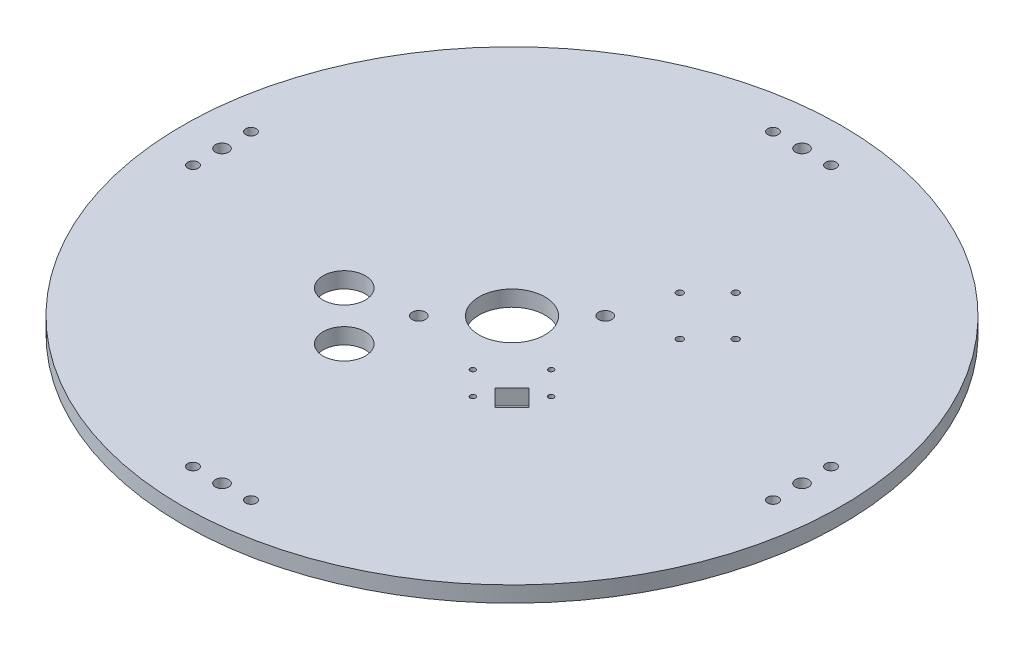
ISO-10303-21;
HEADER;
FILE_DESCRIPTION(('STEP AP214'),'2;1');
FILE_NAME('part.step','',(''),(''),'','','');
FILE_SCHEMA(('AUTOMOTIVE_DESIGN { 1 0 10303 214 1 1 1 1 }'));
ENDSEC;
DATA;
#1=APPLICATION_CONTEXT('core data for automotive mechanical design processes');
#2=APPLICATION_PROTOCOL_DEFINITION('international standard','automotive_design',2000,#1);
#3=PRODUCT_CONTEXT('',#1,'mechanical');
#4=PRODUCT('Part','Part','',(#3));
#5=PRODUCT_RELATED_PRODUCT_CATEGORY('part','',(#4));
#6=PRODUCT_DEFINITION_FORMATION('','',#4);
#7=PRODUCT_DEFINITION_CONTEXT('part definition',#1,'design');
#8=PRODUCT_DEFINITION('design','',#6,#7);
#9=PRODUCT_DEFINITION_SHAPE('','',#8);
#10=(LENGTH_UNIT() NAMED_UNIT(*) SI_UNIT(.MILLI.,.METRE.));
#11=(NAMED_UNIT(*) PLANE_ANGLE_UNIT() SI_UNIT($,.RADIAN.));
#12=(NAMED_UNIT(*) SI_UNIT($,.STERADIAN.) SOLID_ANGLE_UNIT());
#13=UNCERTAINTY_MEASURE_WITH_UNIT(LENGTH_MEASURE(1.E-05),#10,'distance_accuracy_value','');
#14=(GEOMETRIC_REPRESENTATION_CONTEXT(3) GLOBAL_UNCERTAINTY_ASSIGNED_CONTEXT((#13)) GLOBAL_UNIT_ASSIGNED_CONTEXT((#10,
#11,#12)) REPRESENTATION_CONTEXT('',''));
#15=CARTESIAN_POINT('',(0.,0.,0.));
#16=DIRECTION('',(0.,0.,1.));
#17=DIRECTION('',(1.,0.,0.));
#18=AXIS2_PLACEMENT_3D('',#15,#16,#17);
#19=CARTESIAN_POINT('',(0.,6.,0.));
#20=DIRECTION('',(0.,-1.,0.));
#21=DIRECTION('',(0.,0.,-1.));
#22=AXIS2_PLACEMENT_3D('',#19,#20,#21);
#23=CYLINDRICAL_SURFACE('',#22,125.);
#24=CARTESIAN_POINT('',(0.,6.,0.));
#25=DIRECTION('',(0.,1.,0.));
#26=DIRECTION('',(0.,0.,1.));
#27=AXIS2_PLACEMENT_3D('',#24,#25,#26);
#28=CIRCLE('',#27,125.);
#29=CARTESIAN_POINT('',(0.,6.,125.));
#30=VERTEX_POINT('',#29);
#31=EDGE_CURVE('E11',#30,#30,#28,.T.);
#32=ORIENTED_EDGE('',*,*,#31,.F.);
#33=EDGE_LOOP('',(#32));
#34=FACE_BOUND('',#33,.T.);
#35=CARTESIAN_POINT('',(0.,0.,0.));
#36=DIRECTION('',(0.,1.,0.));
#37=DIRECTION('',(0.,0.,1.));
#38=AXIS2_PLACEMENT_3D('',#35,#36,#37);
#39=CIRCLE('',#38,125.);
#40=CARTESIAN_POINT('',(0.,0.,125.));
#41=VERTEX_POINT('',#40);
#42=EDGE_CURVE('E40',#41,#41,#39,.T.);
#43=ORIENTED_EDGE('',*,*,#42,.T.);
#44=EDGE_LOOP('',(#43));
#45=FACE_BOUND('',#44,.T.);
#46=ADVANCED_FACE('F37',(#34,#45),#23,.T.);
#47=CARTESIAN_POINT('',(0.,6.,0.));
#48=DIRECTION('',(0.,1.,0.));
#49=DIRECTION('',(0.,0.,1.));
#50=AXIS2_PLACEMENT_3D('',#47,#48,#49);
#51=PLANE('',#50);
#52=CARTESIAN_POINT('',(-22.6274169979696,6.,41.0121933088197));
#53=DIRECTION('',(0.,1.,0.));
#54=DIRECTION('',(0.,0.,1.));
#55=AXIS2_PLACEMENT_3D('',#52,#53,#54);
#56=CIRCLE('',#55,8.);
#57=CARTESIAN_POINT('',(-22.6274169979696,6.,49.0121933088197));
#58=VERTEX_POINT('',#57);
#59=EDGE_CURVE('E311',#58,#58,#56,.F.);
#60=ORIENTED_EDGE('',*,*,#59,.T.);
#61=EDGE_LOOP('',(#60));
#62=FACE_BOUND('',#61,.T.);
#63=CARTESIAN_POINT('',(-41.0121933088198,6.,22.6274169979694));
#64=DIRECTION('',(0.,1.,0.));
#65=DIRECTION('',(0.,0.,1.));
#66=AXIS2_PLACEMENT_3D('',#63,#64,#65);
#67=CIRCLE('',#66,8.00000000000001);
#68=CARTESIAN_POINT('',(-41.0121933088198,6.,30.6274169979695));
#69=VERTEX_POINT('',#68);
#70=EDGE_CURVE('E314',#69,#69,#67,.F.);
#71=ORIENTED_EDGE('',*,*,#70,.T.);
#72=EDGE_LOOP('',(#71));
#73=FACE_BOUND('',#72,.T.);
#74=CARTESIAN_POINT('',(34.8250089750863,6.,-50.0278047709365));
#75=DIRECTION('',(0.,1.,0.));
#76=DIRECTION('',(0.,0.,1.));
#77=AXIS2_PLACEMENT_3D('',#74,#75,#76);
#78=CIRCLE('',#77,1.24999999959875);
#79=CARTESIAN_POINT('',(34.8250089750863,6.,-48.7778047713378));
#80=VERTEX_POINT('',#79);
#81=EDGE_CURVE('E344',#80,#80,#78,.F.);
#82=ORIENTED_EDGE('',*,*,#81,.T.);
#83=EDGE_LOOP('',(#82));
#84=FACE_BOUND('',#83,.T.);
#85=CARTESIAN_POINT('',(24.2184072572881,6.,-39.4212030531383));
#86=DIRECTION('',(0.,1.,0.));
#87=DIRECTION('',(0.,0.,1.));
#88=AXIS2_PLACEMENT_3D('',#85,#86,#87);
#89=CIRCLE('',#88,1.24999999970731);
#90=CARTESIAN_POINT('',(24.2184072572881,6.,-38.171203053431));
#91=VERTEX_POINT('',#90);
#92=EDGE_CURVE('E341',#91,#91,#89,.F.);
#93=ORIENTED_EDGE('',*,*,#92,.T.);
#94=EDGE_LOOP('',(#93));
#95=FACE_BOUND('',#94,.T.);
#96=CARTESIAN_POINT('',(39.4212030527989,6.,-24.2184072576276));
#97=DIRECTION('',(0.,1.,0.));
#98=DIRECTION('',(0.,0.,1.));
#99=AXIS2_PLACEMENT_3D('',#96,#97,#98);
#100=CIRCLE('',#99,1.25);
#101=CARTESIAN_POINT('',(39.4212030527989,6.,-22.9684072576275));
#102=VERTEX_POINT('',#101);
#103=EDGE_CURVE('E338',#102,#102,#100,.F.);
#104=ORIENTED_EDGE('',*,*,#103,.T.);
#105=EDGE_LOOP('',(#104));
#106=FACE_BOUND('',#105,.T.);
#107=CARTESIAN_POINT('',(50.0278047705971,6.,-34.8250089754258));
#108=DIRECTION('',(0.,1.,0.));
#109=DIRECTION('',(0.,0.,1.));
#110=AXIS2_PLACEMENT_3D('',#107,#108,#109);
#111=CIRCLE('',#110,1.24999999989143);
#112=CARTESIAN_POINT('',(50.0278047705971,6.,-33.5750089755343));
#113=VERTEX_POINT('',#112);
#114=EDGE_CURVE('E327',#113,#113,#111,.F.);
#115=ORIENTED_EDGE('',*,*,#114,.T.);
#116=EDGE_LOOP('',(#115));
#117=FACE_BOUND('',#116,.T.);
#118=CARTESIAN_POINT('',(10.9999999999946,6.,-110.));
#119=DIRECTION('',(0.,1.,0.));
#120=DIRECTION('',(0.,0.,1.));
#121=AXIS2_PLACEMENT_3D('',#118,#119,#120);
#122=CIRCLE('',#121,2.);
#123=CARTESIAN_POINT('',(10.9999999999946,6.,-108.));
#124=VERTEX_POINT('',#123);
#125=EDGE_CURVE('E392',#124,#124,#122,.F.);
#126=ORIENTED_EDGE('',*,*,#125,.T.);
#127=EDGE_LOOP('',(#126));
#128=FACE_BOUND('',#127,.T.);
#129=CARTESIAN_POINT('',(-110.,6.,11.0000000000058));
#130=DIRECTION('',(0.,1.,0.));
#131=DIRECTION('',(0.,0.,1.));
#132=AXIS2_PLACEMENT_3D('',#129,#130,#131);
#133=CIRCLE('',#132,2.00000000000001);
#134=CARTESIAN_POINT('',(-110.,6.,13.0000000000058));
#135=VERTEX_POINT('',#134);
#136=EDGE_CURVE('E389',#135,#135,#133,.F.);
#137=ORIENTED_EDGE('',*,*,#136,.T.);
#138=EDGE_LOOP('',(#137));
#139=FACE_BOUND('',#138,.T.);
#140=CARTESIAN_POINT('',(-110.,6.,-10.9999999999942));
#141=DIRECTION('',(0.,1.,0.));
#142=DIRECTION('',(0.,0.,1.));
#143=AXIS2_PLACEMENT_3D('',#140,#141,#142);
#144=CIRCLE('',#143,2.);
#145=CARTESIAN_POINT('',(-110.,6.,-8.99999999999417));
#146=VERTEX_POINT('',#145);
#147=EDGE_CURVE('E386',#146,#146,#144,.F.);
#148=ORIENTED_EDGE('',*,*,#147,.T.);
#149=EDGE_LOOP('',(#148));
#150=FACE_BOUND('',#149,.T.);
#151=CARTESIAN_POINT('',(11.0000000000062,6.,110.));
#152=DIRECTION('',(0.,1.,0.));
#153=DIRECTION('',(0.,0.,1.));
#154=AXIS2_PLACEMENT_3D('',#151,#152,#153);
#155=CIRCLE('',#154,2.00000000000001);
#156=CARTESIAN_POINT('',(11.0000000000062,6.,112.));
#157=VERTEX_POINT('',#156);
#158=EDGE_CURVE('E383',#157,#157,#155,.F.);
#159=ORIENTED_EDGE('',*,*,#158,.T.);
#160=EDGE_LOOP('',(#159));
#161=FACE_BOUND('',#160,.T.);
#162=CARTESIAN_POINT('',(110.,6.,-11.0000000000051));
#163=DIRECTION('',(0.,1.,0.));
#164=DIRECTION('',(0.,0.,1.));
#165=AXIS2_PLACEMENT_3D('',#162,#163,#164);
#166=CIRCLE('',#165,2.);
#167=CARTESIAN_POINT('',(110.,6.,-9.00000000000506));
#168=VERTEX_POINT('',#167);
#169=EDGE_CURVE('E380',#168,#168,#166,.F.);
#170=ORIENTED_EDGE('',*,*,#169,.T.);
#171=EDGE_LOOP('',(#170));
#172=FACE_BOUND('',#171,.T.);
#173=CARTESIAN_POINT('',(110.,6.,10.9999999999949));
#174=DIRECTION('',(0.,1.,0.));
#175=DIRECTION('',(0.,0.,1.));
#176=AXIS2_PLACEMENT_3D('',#173,#174,#175);
#177=CIRCLE('',#176,2.);
#178=CARTESIAN_POINT('',(110.,6.,12.9999999999949));
#179=VERTEX_POINT('',#178);
#180=EDGE_CURVE('E377',#179,#179,#177,.F.);
#181=ORIENTED_EDGE('',*,*,#180,.T.);
#182=EDGE_LOOP('',(#181));
#183=FACE_BOUND('',#182,.T.);
#184=CARTESIAN_POINT('',(-11.0000000000054,6.,-110.));
#185=DIRECTION('',(0.,1.,0.));
#186=DIRECTION('',(0.,0.,1.));
#187=AXIS2_PLACEMENT_3D('',#184,#185,#186);
#188=CIRCLE('',#187,2.00000000000001);
#189=CARTESIAN_POINT('',(-11.0000000000054,6.,-108.));
#190=VERTEX_POINT('',#189);
#191=EDGE_CURVE('E374',#190,#190,#188,.F.);
#192=ORIENTED_EDGE('',*,*,#191,.T.);
#193=EDGE_LOOP('',(#192));
#194=FACE_BOUND('',#193,.T.);
#195=CARTESIAN_POINT('',(-10.9999999999938,6.,110.));
#196=DIRECTION('',(0.,1.,0.));
#197=DIRECTION('',(0.,0.,1.));
#198=AXIS2_PLACEMENT_3D('',#195,#196,#197);
#199=CIRCLE('',#198,2.);
#200=CARTESIAN_POINT('',(-10.9999999999938,6.,112.));
#201=VERTEX_POINT('',#200);
#202=EDGE_CURVE('E371',#201,#201,#199,.F.);
#203=ORIENTED_EDGE('',*,*,#202,.T.);
#204=EDGE_LOOP('',(#203));
#205=FACE_BOUND('',#204,.T.);
#206=CARTESIAN_POINT('',(19.0918830920367,6.,33.9411254969539));
#207=DIRECTION('',(0.,1.,0.));
#208=DIRECTION('',(0.,0.,1.));
#209=AXIS2_PLACEMENT_3D('',#206,#207,#208);
#210=CIRCLE('',#209,1.);
#211=CARTESIAN_POINT('',(19.0918830920367,6.,34.9411254969539));
#212=VERTEX_POINT('',#211);
#213=EDGE_CURVE('E130',#212,#212,#210,.F.);
#214=ORIENTED_EDGE('',*,*,#213,.T.);
#215=EDGE_LOOP('',(#214));
#216=FACE_BOUND('',#215,.T.);
#217=CARTESIAN_POINT('',(25.1022907321225,6.,10.2530483272047));
#218=DIRECTION('',(0.,1.,0.));
#219=DIRECTION('',(0.,0.,1.));
#220=AXIS2_PLACEMENT_3D('',#217,#218,#219);
#221=CIRCLE('',#220,0.999999999999806);
#222=CARTESIAN_POINT('',(25.1022907321225,6.,11.2530483272045));
#223=VERTEX_POINT('',#222);
#224=EDGE_CURVE('E127',#223,#223,#221,.F.);
#225=ORIENTED_EDGE('',*,*,#224,.T.);
#226=EDGE_LOOP('',(#225));
#227=FACE_BOUND('',#226,.T.);
#228=CARTESIAN_POINT('',(10.2530483272048,6.,25.1022907321221));
#229=DIRECTION('',(0.,1.,0.));
#230=DIRECTION('',(0.,0.,1.));
#231=AXIS2_PLACEMENT_3D('',#228,#229,#230);
#232=CIRCLE('',#231,1.00000000000003);
#233=CARTESIAN_POINT('',(10.2530483272048,6.,26.1022907321221));
#234=VERTEX_POINT('',#233);
#235=EDGE_CURVE('E124',#234,#234,#232,.F.);
#236=ORIENTED_EDGE('',*,*,#235,.T.);
#237=EDGE_LOOP('',(#236));
#238=FACE_BOUND('',#237,.T.);
#239=DIRECTION('',(-0.707106781186548,0.,0.707106781186547));
#240=VECTOR('',#239,1.);
#241=CARTESIAN_POINT('',(30.0520382004282,6.,30.0520382004282));
#242=LINE('',#241,#240);
#243=CARTESIAN_POINT('',(33.2340187157678,6.,26.8700576850885));
#244=VERTEX_POINT('',#243);
#245=CARTESIAN_POINT('',(26.8700576850889,6.,33.2340187157675));
#246=VERTEX_POINT('',#245);
#247=EDGE_CURVE('E118',#244,#246,#242,.T.);
#248=ORIENTED_EDGE('',*,*,#247,.T.);
#249=DIRECTION('',(-0.707106781186548,0.,-0.707106781186547));
#250=VECTOR('',#249,1.);
#251=CARTESIAN_POINT('',(-3.1819805153393,6.,3.1819805153393));
#252=LINE('',#251,#250);
#253=CARTESIAN_POINT('',(20.50609665441,6.,26.8700576850885));
#254=VERTEX_POINT('',#253);
#255=EDGE_CURVE('E121',#246,#254,#252,.T.);
#256=ORIENTED_EDGE('',*,*,#255,.T.);
#257=DIRECTION('',(0.707106781186548,0.,-0.707106781186548));
#258=VECTOR('',#257,1.);
#259=CARTESIAN_POINT('',(23.6880771697493,6.,23.6880771697493));
#260=LINE('',#259,#258);
#261=CARTESIAN_POINT('',(26.8700576850889,6.,20.5060966544096));
#262=VERTEX_POINT('',#261);
#263=EDGE_CURVE('E115',#254,#262,#260,.T.);
#264=ORIENTED_EDGE('',*,*,#263,.T.);
#265=DIRECTION('',(0.707106781186548,0.,0.707106781186547));
#266=VECTOR('',#265,1.);
#267=CARTESIAN_POINT('',(3.18198051533963,6.,-3.18198051533963));
#268=LINE('',#267,#266);
#269=EDGE_CURVE('E83',#262,#244,#268,.T.);
#270=ORIENTED_EDGE('',*,*,#269,.T.);
#271=EDGE_LOOP('',(#248,#256,#264,#270));
#272=FACE_BOUND('',#271,.T.);
#273=CARTESIAN_POINT('',(33.9411254969544,6.,19.0918830920365));
#274=DIRECTION('',(0.,1.,0.));
#275=DIRECTION('',(0.,0.,1.));
#276=AXIS2_PLACEMENT_3D('',#273,#274,#275);
#277=CIRCLE('',#276,0.999999999999781);
#278=CARTESIAN_POINT('',(33.9411254969544,6.,20.0918830920363));
#279=VERTEX_POINT('',#278);
#280=EDGE_CURVE('E112',#279,#279,#277,.F.);
#281=ORIENTED_EDGE('',*,*,#280,.T.);
#282=EDGE_LOOP('',(#281));
#283=FACE_BOUND('',#282,.T.);
#284=CARTESIAN_POINT('',(17.6776695296637,6.,-17.6776695296637));
#285=DIRECTION('',(0.,1.,0.));
#286=DIRECTION('',(0.,0.,1.));
#287=AXIS2_PLACEMENT_3D('',#284,#285,#286);
#288=CIRCLE('',#287,2.5);
#289=CARTESIAN_POINT('',(17.6776695296637,6.,-15.1776695296637));
#290=VERTEX_POINT('',#289);
#291=EDGE_CURVE('E142',#290,#290,#288,.F.);
#292=ORIENTED_EDGE('',*,*,#291,.T.);
#293=EDGE_LOOP('',(#292));
#294=FACE_BOUND('',#293,.T.);
#295=CARTESIAN_POINT('',(-17.6776695296637,6.,17.6776695296637));
#296=DIRECTION('',(0.,1.,0.));
#297=DIRECTION('',(0.,0.,1.));
#298=AXIS2_PLACEMENT_3D('',#295,#296,#297);
#299=CIRCLE('',#298,2.50000000000001);
#300=CARTESIAN_POINT('',(-17.6776695296637,6.,20.1776695296637));
#301=VERTEX_POINT('',#300);
#302=EDGE_CURVE('E137',#301,#301,#299,.F.);
#303=ORIENTED_EDGE('',*,*,#302,.T.);
#304=EDGE_LOOP('',(#303));
#305=FACE_BOUND('',#304,.T.);
#306=CARTESIAN_POINT('',(0.,6.,0.));
#307=DIRECTION('',(0.,1.,0.));
#308=DIRECTION('',(0.,0.,1.));
#309=AXIS2_PLACEMENT_3D('',#306,#307,#308);
#310=CIRCLE('',#309,12.5);
#311=CARTESIAN_POINT('',(0.,6.,12.5));
#312=VERTEX_POINT('',#311);
#313=EDGE_CURVE('E146',#312,#312,#310,.T.);
#314=ORIENTED_EDGE('',*,*,#313,.F.);
#315=EDGE_LOOP('',(#314));
#316=FACE_BOUND('',#315,.T.);
#317=CARTESIAN_POINT('',(0.,6.,-110.));
#318=DIRECTION('',(0.,1.,0.));
#319=DIRECTION('',(0.,0.,1.));
#320=AXIS2_PLACEMENT_3D('',#317,#318,#319);
#321=CIRCLE('',#320,2.5);
#322=CARTESIAN_POINT('',(0.,6.,-107.5));
#323=VERTEX_POINT('',#322);
#324=EDGE_CURVE('E152',#323,#323,#321,.T.);
#325=ORIENTED_EDGE('',*,*,#324,.F.);
#326=EDGE_LOOP('',(#325));
#327=FACE_BOUND('',#326,.T.);
#328=CARTESIAN_POINT('',(110.000000000003,6.,-3.10618136515851E-12));
#329=DIRECTION('',(0.,1.,0.));
#330=DIRECTION('',(0.,0.,1.));
#331=AXIS2_PLACEMENT_3D('',#328,#329,#330);
#332=CIRCLE('',#331,2.50000000000242);
#333=CARTESIAN_POINT('',(110.000000000003,6.,2.49999999999932));
#334=VERTEX_POINT('',#333);
#335=EDGE_CURVE('E161',#334,#334,#332,.T.);
#336=ORIENTED_EDGE('',*,*,#335,.F.);
#337=EDGE_LOOP('',(#336));
#338=FACE_BOUND('',#337,.T.);
#339=CARTESIAN_POINT('',(6.21236273031702E-12,6.,110.));
#340=DIRECTION('',(0.,1.,0.));
#341=DIRECTION('',(0.,0.,1.));
#342=AXIS2_PLACEMENT_3D('',#339,#340,#341);
#343=CIRCLE('',#342,2.50000000000668);
#344=CARTESIAN_POINT('',(6.21236273031702E-12,6.,112.500000000007));
#345=VERTEX_POINT('',#344);
#346=EDGE_CURVE('E167',#345,#345,#343,.T.);
#347=ORIENTED_EDGE('',*,*,#346,.F.);
#348=EDGE_LOOP('',(#347));
#349=FACE_BOUND('',#348,.T.);
#350=CARTESIAN_POINT('',(-109.999999999997,6.,3.11965247994913E-12));
#351=DIRECTION('',(0.,1.,0.));
#352=DIRECTION('',(0.,0.,1.));
#353=AXIS2_PLACEMENT_3D('',#350,#351,#352);
#354=CIRCLE('',#353,2.50000000000499);
#355=CARTESIAN_POINT('',(-109.999999999997,6.,2.50000000000811));
#356=VERTEX_POINT('',#355);
#357=EDGE_CURVE('E149',#356,#356,#354,.T.);
#358=ORIENTED_EDGE('',*,*,#357,.F.);
#359=EDGE_LOOP('',(#358));
#360=FACE_BOUND('',#359,.T.);
#361=ORIENTED_EDGE('',*,*,#31,.T.);
#362=EDGE_LOOP('',(#361));
#363=FACE_BOUND('',#362,.T.);
#364=ADVANCED_FACE('F179',(#62,#73,#84,#95,#106,#117,#128,#139,#150,#161,#172,#183,#194,#205,
#216,#227,#238,#272,#283,#294,#305,#316,#327,#338,#349,#360,#363),#51,.T.);
#365=CARTESIAN_POINT('',(0.,0.,0.));
#366=DIRECTION('',(0.,1.,0.));
#367=DIRECTION('',(0.,0.,1.));
#368=AXIS2_PLACEMENT_3D('',#365,#366,#367);
#369=PLANE('',#368);
#370=CARTESIAN_POINT('',(-22.6274169979696,0.,41.0121933088197));
#371=DIRECTION('',(0.,1.,0.));
#372=DIRECTION('',(0.,0.,1.));
#373=AXIS2_PLACEMENT_3D('',#370,#371,#372);
#374=CIRCLE('',#373,8.);
#375=CARTESIAN_POINT('',(-22.6274169979696,0.,49.0121933088197));
#376=VERTEX_POINT('',#375);
#377=EDGE_CURVE('E313',#376,#376,#374,.T.);
#378=ORIENTED_EDGE('',*,*,#377,.T.);
#379=EDGE_LOOP('',(#378));
#380=FACE_BOUND('',#379,.T.);
#381=CARTESIAN_POINT('',(-41.0121933088198,0.,22.6274169979694));
#382=DIRECTION('',(0.,1.,0.));
#383=DIRECTION('',(0.,0.,1.));
#384=AXIS2_PLACEMENT_3D('',#381,#382,#383);
#385=CIRCLE('',#384,8.00000000000001);
#386=CARTESIAN_POINT('',(-41.0121933088198,0.,30.6274169979695));
#387=VERTEX_POINT('',#386);
#388=EDGE_CURVE('E315',#387,#387,#385,.T.);
#389=ORIENTED_EDGE('',*,*,#388,.T.);
#390=EDGE_LOOP('',(#389));
#391=FACE_BOUND('',#390,.T.);
#392=CARTESIAN_POINT('',(34.8250089750863,0.,-50.0278047709365));
#393=DIRECTION('',(0.,1.,0.));
#394=DIRECTION('',(0.,0.,1.));
#395=AXIS2_PLACEMENT_3D('',#392,#393,#394);
#396=CIRCLE('',#395,1.24999999959875);
#397=CARTESIAN_POINT('',(34.8250089750863,0.,-48.7778047713378));
#398=VERTEX_POINT('',#397);
#399=EDGE_CURVE('E324',#398,#398,#396,.T.);
#400=ORIENTED_EDGE('',*,*,#399,.T.);
#401=EDGE_LOOP('',(#400));
#402=FACE_BOUND('',#401,.T.);
#403=CARTESIAN_POINT('',(24.2184072572881,0.,-39.4212030531383));
#404=DIRECTION('',(0.,1.,0.));
#405=DIRECTION('',(0.,0.,1.));
#406=AXIS2_PLACEMENT_3D('',#403,#404,#405);
#407=CIRCLE('',#406,1.24999999970731);
#408=CARTESIAN_POINT('',(24.2184072572881,0.,-38.171203053431));
#409=VERTEX_POINT('',#408);
#410=EDGE_CURVE('E328',#409,#409,#407,.T.);
#411=ORIENTED_EDGE('',*,*,#410,.T.);
#412=EDGE_LOOP('',(#411));
#413=FACE_BOUND('',#412,.T.);
#414=CARTESIAN_POINT('',(39.4212030527989,0.,-24.2184072576276));
#415=DIRECTION('',(0.,1.,0.));
#416=DIRECTION('',(0.,0.,1.));
#417=AXIS2_PLACEMENT_3D('',#414,#415,#416);
#418=CIRCLE('',#417,1.25);
#419=CARTESIAN_POINT('',(39.4212030527989,0.,-22.9684072576275));
#420=VERTEX_POINT('',#419);
#421=EDGE_CURVE('E331',#420,#420,#418,.T.);
#422=ORIENTED_EDGE('',*,*,#421,.T.);
#423=EDGE_LOOP('',(#422));
#424=FACE_BOUND('',#423,.T.);
#425=CARTESIAN_POINT('',(50.0278047705971,0.,-34.8250089754258));
#426=DIRECTION('',(0.,1.,0.));
#427=DIRECTION('',(0.,0.,1.));
#428=AXIS2_PLACEMENT_3D('',#425,#426,#427);
#429=CIRCLE('',#428,1.24999999989143);
#430=CARTESIAN_POINT('',(50.0278047705971,0.,-33.5750089755343));
#431=VERTEX_POINT('',#430);
#432=EDGE_CURVE('E323',#431,#431,#429,.T.);
#433=ORIENTED_EDGE('',*,*,#432,.T.);
#434=EDGE_LOOP('',(#433));
#435=FACE_BOUND('',#434,.T.);
#436=CARTESIAN_POINT('',(10.9999999999946,0.,-110.));
#437=DIRECTION('',(0.,1.,0.));
#438=DIRECTION('',(0.,0.,1.));
#439=AXIS2_PLACEMENT_3D('',#436,#437,#438);
#440=CIRCLE('',#439,2.);
#441=CARTESIAN_POINT('',(10.9999999999946,0.,-108.));
#442=VERTEX_POINT('',#441);
#443=EDGE_CURVE('E354',#442,#442,#440,.T.);
#444=ORIENTED_EDGE('',*,*,#443,.T.);
#445=EDGE_LOOP('',(#444));
#446=FACE_BOUND('',#445,.T.);
#447=CARTESIAN_POINT('',(-110.,0.,11.0000000000058));
#448=DIRECTION('',(0.,1.,0.));
#449=DIRECTION('',(0.,0.,1.));
#450=AXIS2_PLACEMENT_3D('',#447,#448,#449);
#451=CIRCLE('',#450,2.00000000000001);
#452=CARTESIAN_POINT('',(-110.,0.,13.0000000000058));
#453=VERTEX_POINT('',#452);
#454=EDGE_CURVE('E357',#453,#453,#451,.T.);
#455=ORIENTED_EDGE('',*,*,#454,.T.);
#456=EDGE_LOOP('',(#455));
#457=FACE_BOUND('',#456,.T.);
#458=CARTESIAN_POINT('',(-110.,0.,-10.9999999999942));
#459=DIRECTION('',(0.,1.,0.));
#460=DIRECTION('',(0.,0.,1.));
#461=AXIS2_PLACEMENT_3D('',#458,#459,#460);
#462=CIRCLE('',#461,2.);
#463=CARTESIAN_POINT('',(-110.,0.,-8.99999999999417));
#464=VERTEX_POINT('',#463);
#465=EDGE_CURVE('E360',#464,#464,#462,.T.);
#466=ORIENTED_EDGE('',*,*,#465,.T.);
#467=EDGE_LOOP('',(#466));
#468=FACE_BOUND('',#467,.T.);
#469=CARTESIAN_POINT('',(11.0000000000062,0.,110.));
#470=DIRECTION('',(0.,1.,0.));
#471=DIRECTION('',(0.,0.,1.));
#472=AXIS2_PLACEMENT_3D('',#469,#470,#471);
#473=CIRCLE('',#472,2.00000000000001);
#474=CARTESIAN_POINT('',(11.0000000000062,0.,112.));
#475=VERTEX_POINT('',#474);
#476=EDGE_CURVE('E363',#475,#475,#473,.T.);
#477=ORIENTED_EDGE('',*,*,#476,.T.);
#478=EDGE_LOOP('',(#477));
#479=FACE_BOUND('',#478,.T.);
#480=CARTESIAN_POINT('',(110.,0.,-11.0000000000051));
#481=DIRECTION('',(0.,1.,0.));
#482=DIRECTION('',(0.,0.,1.));
#483=AXIS2_PLACEMENT_3D('',#480,#481,#482);
#484=CIRCLE('',#483,2.);
#485=CARTESIAN_POINT('',(110.,0.,-9.00000000000506));
#486=VERTEX_POINT('',#485);
#487=EDGE_CURVE('E347',#486,#486,#484,.T.);
#488=ORIENTED_EDGE('',*,*,#487,.T.);
#489=EDGE_LOOP('',(#488));
#490=FACE_BOUND('',#489,.T.);
#491=CARTESIAN_POINT('',(110.,0.,10.9999999999949));
#492=DIRECTION('',(0.,1.,0.));
#493=DIRECTION('',(0.,0.,1.));
#494=AXIS2_PLACEMENT_3D('',#491,#492,#493);
#495=CIRCLE('',#494,2.);
#496=CARTESIAN_POINT('',(110.,0.,12.9999999999949));
#497=VERTEX_POINT('',#496);
#498=EDGE_CURVE('E350',#497,#497,#495,.T.);
#499=ORIENTED_EDGE('',*,*,#498,.T.);
#500=EDGE_LOOP('',(#499));
#501=FACE_BOUND('',#500,.T.);
#502=CARTESIAN_POINT('',(-11.0000000000054,0.,-110.));
#503=DIRECTION('',(0.,1.,0.));
#504=DIRECTION('',(0.,0.,1.));
#505=AXIS2_PLACEMENT_3D('',#502,#503,#504);
#506=CIRCLE('',#505,2.00000000000001);
#507=CARTESIAN_POINT('',(-11.0000000000054,0.,-108.));
#508=VERTEX_POINT('',#507);
#509=EDGE_CURVE('E351',#508,#508,#506,.T.);
#510=ORIENTED_EDGE('',*,*,#509,.T.);
#511=EDGE_LOOP('',(#510));
#512=FACE_BOUND('',#511,.T.);
#513=CARTESIAN_POINT('',(-10.9999999999938,0.,110.));
#514=DIRECTION('',(0.,1.,0.));
#515=DIRECTION('',(0.,0.,1.));
#516=AXIS2_PLACEMENT_3D('',#513,#514,#515);
#517=CIRCLE('',#516,2.);
#518=CARTESIAN_POINT('',(-10.9999999999938,0.,112.));
#519=VERTEX_POINT('',#518);
#520=EDGE_CURVE('E366',#519,#519,#517,.T.);
#521=ORIENTED_EDGE('',*,*,#520,.T.);
#522=EDGE_LOOP('',(#521));
#523=FACE_BOUND('',#522,.T.);
#524=CARTESIAN_POINT('',(19.0918830920367,0.,33.9411254969539));
#525=DIRECTION('',(0.,1.,0.));
#526=DIRECTION('',(0.,0.,1.));
#527=AXIS2_PLACEMENT_3D('',#524,#525,#526);
#528=CIRCLE('',#527,1.);
#529=CARTESIAN_POINT('',(19.0918830920367,0.,34.9411254969539));
#530=VERTEX_POINT('',#529);
#531=EDGE_CURVE('E103',#530,#530,#528,.T.);
#532=ORIENTED_EDGE('',*,*,#531,.T.);
#533=EDGE_LOOP('',(#532));
#534=FACE_BOUND('',#533,.T.);
#535=CARTESIAN_POINT('',(25.1022907321225,0.,10.2530483272047));
#536=DIRECTION('',(0.,1.,0.));
#537=DIRECTION('',(0.,0.,1.));
#538=AXIS2_PLACEMENT_3D('',#535,#536,#537);
#539=CIRCLE('',#538,0.999999999999806);
#540=CARTESIAN_POINT('',(25.1022907321225,0.,11.2530483272045));
#541=VERTEX_POINT('',#540);
#542=EDGE_CURVE('E107',#541,#541,#539,.T.);
#543=ORIENTED_EDGE('',*,*,#542,.T.);
#544=EDGE_LOOP('',(#543));
#545=FACE_BOUND('',#544,.T.);
#546=CARTESIAN_POINT('',(10.2530483272048,0.,25.1022907321221));
#547=DIRECTION('',(0.,1.,0.));
#548=DIRECTION('',(0.,0.,1.));
#549=AXIS2_PLACEMENT_3D('',#546,#547,#548);
#550=CIRCLE('',#549,1.00000000000003);
#551=CARTESIAN_POINT('',(10.2530483272048,0.,26.1022907321221));
#552=VERTEX_POINT('',#551);
#553=EDGE_CURVE('E102',#552,#552,#550,.T.);
#554=ORIENTED_EDGE('',*,*,#553,.T.);
#555=EDGE_LOOP('',(#554));
#556=FACE_BOUND('',#555,.T.);
#557=DIRECTION('',(0.707106781186548,0.,0.707106781186547));
#558=VECTOR('',#557,1.);
#559=CARTESIAN_POINT('',(26.8700576850889,0.,33.2340187157675));
#560=LINE('',#559,#558);
#561=CARTESIAN_POINT('',(20.50609665441,0.,26.8700576850885));
#562=VERTEX_POINT('',#561);
#563=CARTESIAN_POINT('',(26.8700576850889,0.,33.2340187157675));
#564=VERTEX_POINT('',#563);
#565=EDGE_CURVE('E59',#562,#564,#560,.T.);
#566=ORIENTED_EDGE('',*,*,#565,.T.);
#567=DIRECTION('',(0.707106781186548,0.,-0.707106781186547));
#568=VECTOR('',#567,1.);
#569=CARTESIAN_POINT('',(33.2340187157678,0.,26.8700576850885));
#570=LINE('',#569,#568);
#571=CARTESIAN_POINT('',(33.2340187157678,0.,26.8700576850885));
#572=VERTEX_POINT('',#571);
#573=EDGE_CURVE('E96',#564,#572,#570,.T.);
#574=ORIENTED_EDGE('',*,*,#573,.T.);
#575=DIRECTION('',(-0.707106781186548,0.,-0.707106781186547));
#576=VECTOR('',#575,1.);
#577=CARTESIAN_POINT('',(33.2340187157678,0.,26.8700576850885));
#578=LINE('',#577,#576);
#579=CARTESIAN_POINT('',(26.8700576850889,0.,20.5060966544096));
#580=VERTEX_POINT('',#579);
#581=EDGE_CURVE('E80',#572,#580,#578,.T.);
#582=ORIENTED_EDGE('',*,*,#581,.T.);
#583=DIRECTION('',(-0.707106781186548,0.,0.707106781186548));
#584=VECTOR('',#583,1.);
#585=CARTESIAN_POINT('',(26.8700576850889,0.,20.5060966544096));
#586=LINE('',#585,#584);
#587=EDGE_CURVE('E89',#580,#562,#586,.T.);
#588=ORIENTED_EDGE('',*,*,#587,.T.);
#589=EDGE_LOOP('',(#566,#574,#582,#588));
#590=FACE_BOUND('',#589,.T.);
#591=CARTESIAN_POINT('',(33.9411254969544,0.,19.0918830920365));
#592=DIRECTION('',(0.,1.,0.));
#593=DIRECTION('',(0.,0.,1.));
#594=AXIS2_PLACEMENT_3D('',#591,#592,#593);
#595=CIRCLE('',#594,0.999999999999781);
#596=CARTESIAN_POINT('',(33.9411254969544,0.,20.0918830920363));
#597=VERTEX_POINT('',#596);
#598=EDGE_CURVE('E106',#597,#597,#595,.T.);
#599=ORIENTED_EDGE('',*,*,#598,.T.);
#600=EDGE_LOOP('',(#599));
#601=FACE_BOUND('',#600,.T.);
#602=CARTESIAN_POINT('',(17.6776695296637,0.,-17.6776695296637));
#603=DIRECTION('',(0.,1.,0.));
#604=DIRECTION('',(0.,0.,1.));
#605=AXIS2_PLACEMENT_3D('',#602,#603,#604);
#606=CIRCLE('',#605,2.5);
#607=CARTESIAN_POINT('',(17.6776695296637,0.,-15.1776695296637));
#608=VERTEX_POINT('',#607);
#609=EDGE_CURVE('E134',#608,#608,#606,.T.);
#610=ORIENTED_EDGE('',*,*,#609,.T.);
#611=EDGE_LOOP('',(#610));
#612=FACE_BOUND('',#611,.T.);
#613=CARTESIAN_POINT('',(-17.6776695296637,0.,17.6776695296637));
#614=DIRECTION('',(0.,1.,0.));
#615=DIRECTION('',(0.,0.,1.));
#616=AXIS2_PLACEMENT_3D('',#613,#614,#615);
#617=CIRCLE('',#616,2.50000000000001);
#618=CARTESIAN_POINT('',(-17.6776695296637,0.,20.1776695296637));
#619=VERTEX_POINT('',#618);
#620=EDGE_CURVE('E133',#619,#619,#617,.T.);
#621=ORIENTED_EDGE('',*,*,#620,.T.);
#622=EDGE_LOOP('',(#621));
#623=FACE_BOUND('',#622,.T.);
#624=CARTESIAN_POINT('',(0.,0.,0.));
#625=DIRECTION('',(0.,1.,0.));
#626=DIRECTION('',(0.,0.,1.));
#627=AXIS2_PLACEMENT_3D('',#624,#625,#626);
#628=CIRCLE('',#627,12.5);
#629=CARTESIAN_POINT('',(0.,0.,12.5));
#630=VERTEX_POINT('',#629);
#631=EDGE_CURVE('E145',#630,#630,#628,.T.);
#632=ORIENTED_EDGE('',*,*,#631,.T.);
#633=EDGE_LOOP('',(#632));
#634=FACE_BOUND('',#633,.T.);
#635=CARTESIAN_POINT('',(0.,0.,-110.));
#636=DIRECTION('',(0.,1.,0.));
#637=DIRECTION('',(0.,0.,1.));
#638=AXIS2_PLACEMENT_3D('',#635,#636,#637);
#639=CIRCLE('',#638,2.5);
#640=CARTESIAN_POINT('',(0.,0.,-107.5));
#641=VERTEX_POINT('',#640);
#642=EDGE_CURVE('E155',#641,#641,#639,.T.);
#643=ORIENTED_EDGE('',*,*,#642,.T.);
#644=EDGE_LOOP('',(#643));
#645=FACE_BOUND('',#644,.T.);
#646=CARTESIAN_POINT('',(110.000000000003,0.,-3.10618136515851E-12));
#647=DIRECTION('',(0.,1.,0.));
#648=DIRECTION('',(0.,0.,1.));
#649=AXIS2_PLACEMENT_3D('',#646,#647,#648);
#650=CIRCLE('',#649,2.50000000000242);
#651=CARTESIAN_POINT('',(110.000000000003,0.,2.49999999999932));
#652=VERTEX_POINT('',#651);
#653=EDGE_CURVE('E158',#652,#652,#650,.T.);
#654=ORIENTED_EDGE('',*,*,#653,.T.);
#655=EDGE_LOOP('',(#654));
#656=FACE_BOUND('',#655,.T.);
#657=CARTESIAN_POINT('',(6.21236273031702E-12,0.,110.));
#658=DIRECTION('',(0.,1.,0.));
#659=DIRECTION('',(0.,0.,1.));
#660=AXIS2_PLACEMENT_3D('',#657,#658,#659);
#661=CIRCLE('',#660,2.50000000000668);
#662=CARTESIAN_POINT('',(6.21236273031702E-12,0.,112.500000000007));
#663=VERTEX_POINT('',#662);
#664=EDGE_CURVE('E164',#663,#663,#661,.T.);
#665=ORIENTED_EDGE('',*,*,#664,.T.);
#666=EDGE_LOOP('',(#665));
#667=FACE_BOUND('',#666,.T.);
#668=CARTESIAN_POINT('',(-109.999999999997,0.,3.11965247994913E-12));
#669=DIRECTION('',(0.,1.,0.));
#670=DIRECTION('',(0.,0.,1.));
#671=AXIS2_PLACEMENT_3D('',#668,#669,#670);
#672=CIRCLE('',#671,2.50000000000499);
#673=CARTESIAN_POINT('',(-109.999999999997,0.,2.50000000000811));
#674=VERTEX_POINT('',#673);
#675=EDGE_CURVE('E170',#674,#674,#672,.T.);
#676=ORIENTED_EDGE('',*,*,#675,.T.);
#677=EDGE_LOOP('',(#676));
#678=FACE_BOUND('',#677,.T.);
#679=ORIENTED_EDGE('',*,*,#42,.F.);
#680=EDGE_LOOP('',(#679));
#681=FACE_BOUND('',#680,.T.);
#682=ADVANCED_FACE('F93',(#380,#391,#402,#413,#424,#435,#446,#457,#468,#479,#490,#501,#512,#523,
#534,#545,#556,#590,#601,#612,#623,#634,#645,#656,#667,#678,#681),#369,.F.);
#683=CARTESIAN_POINT('',(-109.999999999997,6.,3.11965247994913E-12));
#684=DIRECTION('',(0.,-1.,0.));
#685=DIRECTION('',(0.,0.,-1.));
#686=AXIS2_PLACEMENT_3D('',#683,#684,#685);
#687=CYLINDRICAL_SURFACE('',#686,2.50000000000499);
#688=ORIENTED_EDGE('',*,*,#357,.T.);
#689=EDGE_LOOP('',(#688));
#690=FACE_BOUND('',#689,.T.);
#691=ORIENTED_EDGE('',*,*,#675,.F.);
#692=EDGE_LOOP('',(#691));
#693=FACE_BOUND('',#692,.T.);
#694=ADVANCED_FACE('F176',(#690,#693),#687,.F.);
#695=CARTESIAN_POINT('',(6.21236273031702E-12,6.,110.));
#696=DIRECTION('',(0.,-1.,0.));
#697=DIRECTION('',(0.,0.,-1.));
#698=AXIS2_PLACEMENT_3D('',#695,#696,#697);
#699=CYLINDRICAL_SURFACE('',#698,2.50000000000668);
#700=ORIENTED_EDGE('',*,*,#346,.T.);
#701=EDGE_LOOP('',(#700));
#702=FACE_BOUND('',#701,.T.);
#703=ORIENTED_EDGE('',*,*,#664,.F.);
#704=EDGE_LOOP('',(#703));
#705=FACE_BOUND('',#704,.T.);
#706=ADVANCED_FACE('F196',(#702,#705),#699,.F.);
#707=CARTESIAN_POINT('',(110.000000000003,6.,-3.10618136515851E-12));
#708=DIRECTION('',(0.,-1.,0.));
#709=DIRECTION('',(0.,0.,-1.));
#710=AXIS2_PLACEMENT_3D('',#707,#708,#709);
#711=CYLINDRICAL_SURFACE('',#710,2.50000000000242);
#712=ORIENTED_EDGE('',*,*,#335,.T.);
#713=EDGE_LOOP('',(#712));
#714=FACE_BOUND('',#713,.T.);
#715=ORIENTED_EDGE('',*,*,#653,.F.);
#716=EDGE_LOOP('',(#715));
#717=FACE_BOUND('',#716,.T.);
#718=ADVANCED_FACE('F203',(#714,#717),#711,.F.);
#719=CARTESIAN_POINT('',(0.,6.,-110.));
#720=DIRECTION('',(0.,-1.,0.));
#721=DIRECTION('',(0.,0.,-1.));
#722=AXIS2_PLACEMENT_3D('',#719,#720,#721);
#723=CYLINDRICAL_SURFACE('',#722,2.5);
#724=ORIENTED_EDGE('',*,*,#324,.T.);
#725=EDGE_LOOP('',(#724));
#726=FACE_BOUND('',#725,.T.);
#727=ORIENTED_EDGE('',*,*,#642,.F.);
#728=EDGE_LOOP('',(#727));
#729=FACE_BOUND('',#728,.T.);
#730=ADVANCED_FACE('F207',(#726,#729),#723,.F.);
#731=CARTESIAN_POINT('',(0.,6.,0.));
#732=DIRECTION('',(0.,-1.,0.));
#733=DIRECTION('',(0.,0.,-1.));
#734=AXIS2_PLACEMENT_3D('',#731,#732,#733);
#735=CYLINDRICAL_SURFACE('',#734,12.5);
#736=ORIENTED_EDGE('',*,*,#313,.T.);
#737=EDGE_LOOP('',(#736));
#738=FACE_BOUND('',#737,.T.);
#739=ORIENTED_EDGE('',*,*,#631,.F.);
#740=EDGE_LOOP('',(#739));
#741=FACE_BOUND('',#740,.T.);
#742=ADVANCED_FACE('F211',(#738,#741),#735,.F.);
#743=CARTESIAN_POINT('',(-17.6776695296637,10.,17.6776695296637));
#744=DIRECTION('',(0.,-1.,0.));
#745=DIRECTION('',(0.,0.,-1.));
#746=AXIS2_PLACEMENT_3D('',#743,#744,#745);
#747=CYLINDRICAL_SURFACE('',#746,2.50000000000001);
#748=ORIENTED_EDGE('',*,*,#302,.F.);
#749=EDGE_LOOP('',(#748));
#750=FACE_BOUND('',#749,.T.);
#751=ORIENTED_EDGE('',*,*,#620,.F.);
#752=EDGE_LOOP('',(#751));
#753=FACE_BOUND('',#752,.T.);
#754=ADVANCED_FACE('F215',(#750,#753),#747,.F.);
#755=CARTESIAN_POINT('',(17.6776695296637,10.,-17.6776695296637));
#756=DIRECTION('',(0.,-1.,0.));
#757=DIRECTION('',(0.,0.,-1.));
#758=AXIS2_PLACEMENT_3D('',#755,#756,#757);
#759=CYLINDRICAL_SURFACE('',#758,2.5);
#760=ORIENTED_EDGE('',*,*,#291,.F.);
#761=EDGE_LOOP('',(#760));
#762=FACE_BOUND('',#761,.T.);
#763=ORIENTED_EDGE('',*,*,#609,.F.);
#764=EDGE_LOOP('',(#763));
#765=FACE_BOUND('',#764,.T.);
#766=ADVANCED_FACE('F219',(#762,#765),#759,.F.);
#767=CARTESIAN_POINT('',(33.9411254969544,10.,19.0918830920365));
#768=DIRECTION('',(0.,-1.,0.));
#769=DIRECTION('',(0.,0.,-1.));
#770=AXIS2_PLACEMENT_3D('',#767,#768,#769);
#771=CYLINDRICAL_SURFACE('',#770,0.999999999999781);
#772=ORIENTED_EDGE('',*,*,#280,.F.);
#773=EDGE_LOOP('',(#772));
#774=FACE_BOUND('',#773,.T.);
#775=ORIENTED_EDGE('',*,*,#598,.F.);
#776=EDGE_LOOP('',(#775));
#777=FACE_BOUND('',#776,.T.);
#778=ADVANCED_FACE('F223',(#774,#777),#771,.F.);
#779=CARTESIAN_POINT('',(26.8700576850889,10.,33.2340187157675));
#780=DIRECTION('',(0.707106781186547,0.,-0.707106781186548));
#781=DIRECTION('',(-0.707106781186548,0.,-0.707106781186547));
#782=AXIS2_PLACEMENT_3D('',#779,#780,#781);
#783=PLANE('',#782);
#784=DIRECTION('',(0.,-1.,0.));
#785=VECTOR('',#784,1.);
#786=CARTESIAN_POINT('',(26.8700576850889,10.,33.2340187157675));
#787=LINE('',#786,#785);
#788=EDGE_CURVE('E395',#246,#564,#787,.T.);
#789=ORIENTED_EDGE('',*,*,#788,.T.);
#790=ORIENTED_EDGE('',*,*,#565,.F.);
#791=DIRECTION('',(0.,-1.,0.));
#792=VECTOR('',#791,1.);
#793=CARTESIAN_POINT('',(20.50609665441,10.,26.8700576850885));
#794=LINE('',#793,#792);
#795=EDGE_CURVE('E85',#254,#562,#794,.T.);
#796=ORIENTED_EDGE('',*,*,#795,.F.);
#797=ORIENTED_EDGE('',*,*,#255,.F.);
#798=EDGE_LOOP('',(#789,#790,#796,#797));
#799=FACE_BOUND('',#798,.T.);
#800=ADVANCED_FACE('F227',(#799),#783,.T.);
#801=CARTESIAN_POINT('',(33.2340187157678,10.,26.8700576850885));
#802=DIRECTION('',(-0.707106781186547,0.,-0.707106781186548));
#803=DIRECTION('',(-0.707106781186548,0.,0.707106781186547));
#804=AXIS2_PLACEMENT_3D('',#801,#802,#803);
#805=PLANE('',#804);
#806=DIRECTION('',(0.,-1.,0.));
#807=VECTOR('',#806,1.);
#808=CARTESIAN_POINT('',(33.2340187157678,10.,26.8700576850885));
#809=LINE('',#808,#807);
#810=EDGE_CURVE('E86',#244,#572,#809,.T.);
#811=ORIENTED_EDGE('',*,*,#810,.T.);
#812=ORIENTED_EDGE('',*,*,#573,.F.);
#813=ORIENTED_EDGE('',*,*,#788,.F.);
#814=ORIENTED_EDGE('',*,*,#247,.F.);
#815=EDGE_LOOP('',(#811,#812,#813,#814));
#816=FACE_BOUND('',#815,.T.);
#817=ADVANCED_FACE('F243',(#816),#805,.T.);
#818=CARTESIAN_POINT('',(33.2340187157678,10.,26.8700576850885));
#819=DIRECTION('',(-0.707106781186547,0.,0.707106781186548));
#820=DIRECTION('',(0.707106781186548,0.,0.707106781186547));
#821=AXIS2_PLACEMENT_3D('',#818,#819,#820);
#822=PLANE('',#821);
#823=DIRECTION('',(0.,-1.,0.));
#824=VECTOR('',#823,1.);
#825=CARTESIAN_POINT('',(26.8700576850889,10.,20.5060966544096));
#826=LINE('',#825,#824);
#827=EDGE_CURVE('E51',#262,#580,#826,.T.);
#828=ORIENTED_EDGE('',*,*,#827,.T.);
#829=ORIENTED_EDGE('',*,*,#581,.F.);
#830=ORIENTED_EDGE('',*,*,#810,.F.);
#831=ORIENTED_EDGE('',*,*,#269,.F.);
#832=EDGE_LOOP('',(#828,#829,#830,#831));
#833=FACE_BOUND('',#832,.T.);
#834=ADVANCED_FACE('F77',(#833),#822,.T.);
#835=CARTESIAN_POINT('',(26.8700576850889,10.,20.5060966544096));
#836=DIRECTION('',(0.707106781186548,0.,0.707106781186548));
#837=DIRECTION('',(0.707106781186548,0.,-0.707106781186548));
#838=AXIS2_PLACEMENT_3D('',#835,#836,#837);
#839=PLANE('',#838);
#840=ORIENTED_EDGE('',*,*,#795,.T.);
#841=ORIENTED_EDGE('',*,*,#587,.F.);
#842=ORIENTED_EDGE('',*,*,#827,.F.);
#843=ORIENTED_EDGE('',*,*,#263,.F.);
#844=EDGE_LOOP('',(#840,#841,#842,#843));
#845=FACE_BOUND('',#844,.T.);
#846=ADVANCED_FACE('F90',(#845),#839,.T.);
#847=CARTESIAN_POINT('',(10.2530483272048,10.,25.1022907321221));
#848=DIRECTION('',(0.,-1.,0.));
#849=DIRECTION('',(0.,0.,-1.));
#850=AXIS2_PLACEMENT_3D('',#847,#848,#849);
#851=CYLINDRICAL_SURFACE('',#850,1.00000000000003);
#852=ORIENTED_EDGE('',*,*,#235,.F.);
#853=EDGE_LOOP('',(#852));
#854=FACE_BOUND('',#853,.T.);
#855=ORIENTED_EDGE('',*,*,#553,.F.);
#856=EDGE_LOOP('',(#855));
#857=FACE_BOUND('',#856,.T.);
#858=ADVANCED_FACE('F233',(#854,#857),#851,.F.);
#859=CARTESIAN_POINT('',(25.1022907321225,10.,10.2530483272047));
#860=DIRECTION('',(0.,-1.,0.));
#861=DIRECTION('',(0.,0.,-1.));
#862=AXIS2_PLACEMENT_3D('',#859,#860,#861);
#863=CYLINDRICAL_SURFACE('',#862,0.999999999999806);
#864=ORIENTED_EDGE('',*,*,#224,.F.);
#865=EDGE_LOOP('',(#864));
#866=FACE_BOUND('',#865,.T.);
#867=ORIENTED_EDGE('',*,*,#542,.F.);
#868=EDGE_LOOP('',(#867));
#869=FACE_BOUND('',#868,.T.);
#870=ADVANCED_FACE('F229',(#866,#869),#863,.F.);
#871=CARTESIAN_POINT('',(19.0918830920367,10.,33.9411254969539));
#872=DIRECTION('',(0.,-1.,0.));
#873=DIRECTION('',(0.,0.,-1.));
#874=AXIS2_PLACEMENT_3D('',#871,#872,#873);
#875=CYLINDRICAL_SURFACE('',#874,1.);
#876=ORIENTED_EDGE('',*,*,#213,.F.);
#877=EDGE_LOOP('',(#876));
#878=FACE_BOUND('',#877,.T.);
#879=ORIENTED_EDGE('',*,*,#531,.F.);
#880=EDGE_LOOP('',(#879));
#881=FACE_BOUND('',#880,.T.);
#882=ADVANCED_FACE('F232',(#878,#881),#875,.F.);
#883=CARTESIAN_POINT('',(-10.9999999999938,10.,110.));
#884=DIRECTION('',(0.,-1.,0.));
#885=DIRECTION('',(0.,0.,-1.));
#886=AXIS2_PLACEMENT_3D('',#883,#884,#885);
#887=CYLINDRICAL_SURFACE('',#886,2.);
#888=ORIENTED_EDGE('',*,*,#202,.F.);
#889=EDGE_LOOP('',(#888));
#890=FACE_BOUND('',#889,.T.);
#891=ORIENTED_EDGE('',*,*,#520,.F.);
#892=EDGE_LOOP('',(#891));
#893=FACE_BOUND('',#892,.T.);
#894=ADVANCED_FACE('F237',(#890,#893),#887,.F.);
#895=CARTESIAN_POINT('',(-11.0000000000054,10.,-110.));
#896=DIRECTION('',(0.,-1.,0.));
#897=DIRECTION('',(0.,0.,-1.));
#898=AXIS2_PLACEMENT_3D('',#895,#896,#897);
#899=CYLINDRICAL_SURFACE('',#898,2.00000000000001);
#900=ORIENTED_EDGE('',*,*,#191,.F.);
#901=EDGE_LOOP('',(#900));
#902=FACE_BOUND('',#901,.T.);
#903=ORIENTED_EDGE('',*,*,#509,.F.);
#904=EDGE_LOOP('',(#903));
#905=FACE_BOUND('',#904,.T.);
#906=ADVANCED_FACE('F254',(#902,#905),#899,.F.);
#907=CARTESIAN_POINT('',(110.,10.,10.9999999999949));
#908=DIRECTION('',(0.,-1.,0.));
#909=DIRECTION('',(0.,0.,-1.));
#910=AXIS2_PLACEMENT_3D('',#907,#908,#909);
#911=CYLINDRICAL_SURFACE('',#910,2.);
#912=ORIENTED_EDGE('',*,*,#180,.F.);
#913=EDGE_LOOP('',(#912));
#914=FACE_BOUND('',#913,.T.);
#915=ORIENTED_EDGE('',*,*,#498,.F.);
#916=EDGE_LOOP('',(#915));
#917=FACE_BOUND('',#916,.T.);
#918=ADVANCED_FACE('F274',(#914,#917),#911,.F.);
#919=CARTESIAN_POINT('',(110.,10.,-11.0000000000051));
#920=DIRECTION('',(0.,-1.,0.));
#921=DIRECTION('',(0.,0.,-1.));
#922=AXIS2_PLACEMENT_3D('',#919,#920,#921);
#923=CYLINDRICAL_SURFACE('',#922,2.);
#924=ORIENTED_EDGE('',*,*,#169,.F.);
#925=EDGE_LOOP('',(#924));
#926=FACE_BOUND('',#925,.T.);
#927=ORIENTED_EDGE('',*,*,#487,.F.);
#928=EDGE_LOOP('',(#927));
#929=FACE_BOUND('',#928,.T.);
#930=ADVANCED_FACE('F264',(#926,#929),#923,.F.);
#931=CARTESIAN_POINT('',(11.0000000000062,10.,110.));
#932=DIRECTION('',(0.,-1.,0.));
#933=DIRECTION('',(0.,0.,-1.));
#934=AXIS2_PLACEMENT_3D('',#931,#932,#933);
#935=CYLINDRICAL_SURFACE('',#934,2.00000000000001);
#936=ORIENTED_EDGE('',*,*,#158,.F.);
#937=EDGE_LOOP('',(#936));
#938=FACE_BOUND('',#937,.T.);
#939=ORIENTED_EDGE('',*,*,#476,.F.);
#940=EDGE_LOOP('',(#939));
#941=FACE_BOUND('',#940,.T.);
#942=ADVANCED_FACE('F260',(#938,#941),#935,.F.);
#943=CARTESIAN_POINT('',(-110.,10.,-10.9999999999942));
#944=DIRECTION('',(0.,-1.,0.));
#945=DIRECTION('',(0.,0.,-1.));
#946=AXIS2_PLACEMENT_3D('',#943,#944,#945);
#947=CYLINDRICAL_SURFACE('',#946,2.);
#948=ORIENTED_EDGE('',*,*,#147,.F.);
#949=EDGE_LOOP('',(#948));
#950=FACE_BOUND('',#949,.T.);
#951=ORIENTED_EDGE('',*,*,#465,.F.);
#952=EDGE_LOOP('',(#951));
#953=FACE_BOUND('',#952,.T.);
#954=ADVANCED_FACE('F256',(#950,#953),#947,.F.);
#955=CARTESIAN_POINT('',(-110.,10.,11.0000000000058));
#956=DIRECTION('',(0.,-1.,0.));
#957=DIRECTION('',(0.,0.,-1.));
#958=AXIS2_PLACEMENT_3D('',#955,#956,#957);
#959=CYLINDRICAL_SURFACE('',#958,2.00000000000001);
#960=ORIENTED_EDGE('',*,*,#136,.F.);
#961=EDGE_LOOP('',(#960));
#962=FACE_BOUND('',#961,.T.);
#963=ORIENTED_EDGE('',*,*,#454,.F.);
#964=EDGE_LOOP('',(#963));
#965=FACE_BOUND('',#964,.T.);
#966=ADVANCED_FACE('F259',(#962,#965),#959,.F.);
#967=CARTESIAN_POINT('',(10.9999999999946,10.,-110.));
#968=DIRECTION('',(0.,-1.,0.));
#969=DIRECTION('',(0.,0.,-1.));
#970=AXIS2_PLACEMENT_3D('',#967,#968,#969);
#971=CYLINDRICAL_SURFACE('',#970,2.);
#972=ORIENTED_EDGE('',*,*,#125,.F.);
#973=EDGE_LOOP('',(#972));
#974=FACE_BOUND('',#973,.T.);
#975=ORIENTED_EDGE('',*,*,#443,.F.);
#976=EDGE_LOOP('',(#975));
#977=FACE_BOUND('',#976,.T.);
#978=ADVANCED_FACE('F266',(#974,#977),#971,.F.);
#979=CARTESIAN_POINT('',(50.0278047705971,10.,-34.8250089754258));
#980=DIRECTION('',(0.,-1.,0.));
#981=DIRECTION('',(0.,0.,-1.));
#982=AXIS2_PLACEMENT_3D('',#979,#980,#981);
#983=CYLINDRICAL_SURFACE('',#982,1.24999999989143);
#984=ORIENTED_EDGE('',*,*,#114,.F.);
#985=EDGE_LOOP('',(#984));
#986=FACE_BOUND('',#985,.T.);
#987=ORIENTED_EDGE('',*,*,#432,.F.);
#988=EDGE_LOOP('',(#987));
#989=FACE_BOUND('',#988,.T.);
#990=ADVANCED_FACE('F269',(#986,#989),#983,.F.);
#991=CARTESIAN_POINT('',(39.4212030527989,10.,-24.2184072576276));
#992=DIRECTION('',(0.,-1.,0.));
#993=DIRECTION('',(0.,0.,-1.));
#994=AXIS2_PLACEMENT_3D('',#991,#992,#993);
#995=CYLINDRICAL_SURFACE('',#994,1.25);
#996=ORIENTED_EDGE('',*,*,#103,.F.);
#997=EDGE_LOOP('',(#996));
#998=FACE_BOUND('',#997,.T.);
#999=ORIENTED_EDGE('',*,*,#421,.F.);
#1000=EDGE_LOOP('',(#999));
#1001=FACE_BOUND('',#1000,.T.);
#1002=ADVANCED_FACE('F286',(#998,#1001),#995,.F.);
#1003=CARTESIAN_POINT('',(24.2184072572881,10.,-39.4212030531383));
#1004=DIRECTION('',(0.,-1.,0.));
#1005=DIRECTION('',(0.,0.,-1.));
#1006=AXIS2_PLACEMENT_3D('',#1003,#1004,#1005);
#1007=CYLINDRICAL_SURFACE('',#1006,1.24999999970731);
#1008=ORIENTED_EDGE('',*,*,#92,.F.);
#1009=EDGE_LOOP('',(#1008));
#1010=FACE_BOUND('',#1009,.T.);
#1011=ORIENTED_EDGE('',*,*,#410,.F.);
#1012=EDGE_LOOP('',(#1011));
#1013=FACE_BOUND('',#1012,.T.);
#1014=ADVANCED_FACE('F290',(#1010,#1013),#1007,.F.);
#1015=CARTESIAN_POINT('',(34.8250089750863,10.,-50.0278047709365));
#1016=DIRECTION('',(0.,-1.,0.));
#1017=DIRECTION('',(0.,0.,-1.));
#1018=AXIS2_PLACEMENT_3D('',#1015,#1016,#1017);
#1019=CYLINDRICAL_SURFACE('',#1018,1.24999999959875);
#1020=ORIENTED_EDGE('',*,*,#81,.F.);
#1021=EDGE_LOOP('',(#1020));
#1022=FACE_BOUND('',#1021,.T.);
#1023=ORIENTED_EDGE('',*,*,#399,.F.);
#1024=EDGE_LOOP('',(#1023));
#1025=FACE_BOUND('',#1024,.T.);
#1026=ADVANCED_FACE('F294',(#1022,#1025),#1019,.F.);
#1027=CARTESIAN_POINT('',(-41.0121933088198,10.,22.6274169979694));
#1028=DIRECTION('',(0.,-1.,0.));
#1029=DIRECTION('',(0.,0.,-1.));
#1030=AXIS2_PLACEMENT_3D('',#1027,#1028,#1029);
#1031=CYLINDRICAL_SURFACE('',#1030,8.00000000000001);
#1032=ORIENTED_EDGE('',*,*,#70,.F.);
#1033=EDGE_LOOP('',(#1032));
#1034=FACE_BOUND('',#1033,.T.);
#1035=ORIENTED_EDGE('',*,*,#388,.F.);
#1036=EDGE_LOOP('',(#1035));
#1037=FACE_BOUND('',#1036,.T.);
#1038=ADVANCED_FACE('F298',(#1034,#1037),#1031,.F.);
#1039=CARTESIAN_POINT('',(-22.6274169979696,10.,41.0121933088197));
#1040=DIRECTION('',(0.,-1.,0.));
#1041=DIRECTION('',(0.,0.,-1.));
#1042=AXIS2_PLACEMENT_3D('',#1039,#1040,#1041);
#1043=CYLINDRICAL_SURFACE('',#1042,8.);
#1044=ORIENTED_EDGE('',*,*,#59,.F.);
#1045=EDGE_LOOP('',(#1044));
#1046=FACE_BOUND('',#1045,.T.);
#1047=ORIENTED_EDGE('',*,*,#377,.F.);
#1048=EDGE_LOOP('',(#1047));
#1049=FACE_BOUND('',#1048,.T.);
#1050=ADVANCED_FACE('F302',(#1046,#1049),#1043,.F.);
#1051=CLOSED_SHELL('',(#46,#364,#682,#694,#706,#718,#730,#742,#754,#766,#778,#800,#817,#834,
#846,#858,#870,#882,#894,#906,#918,#930,#942,#954,#966,#978,#990,#1002,#1014,#1026,#1038,#1050));
#1052=MANIFOLD_SOLID_BREP('B2',#1051);
#1053=ADVANCED_BREP_SHAPE_REPRESENTATION('',(#18,#1052),#14);
#1054=SHAPE_DEFINITION_REPRESENTATION(#9,#1053);
ENDSEC;
END-ISO-10303-21;
